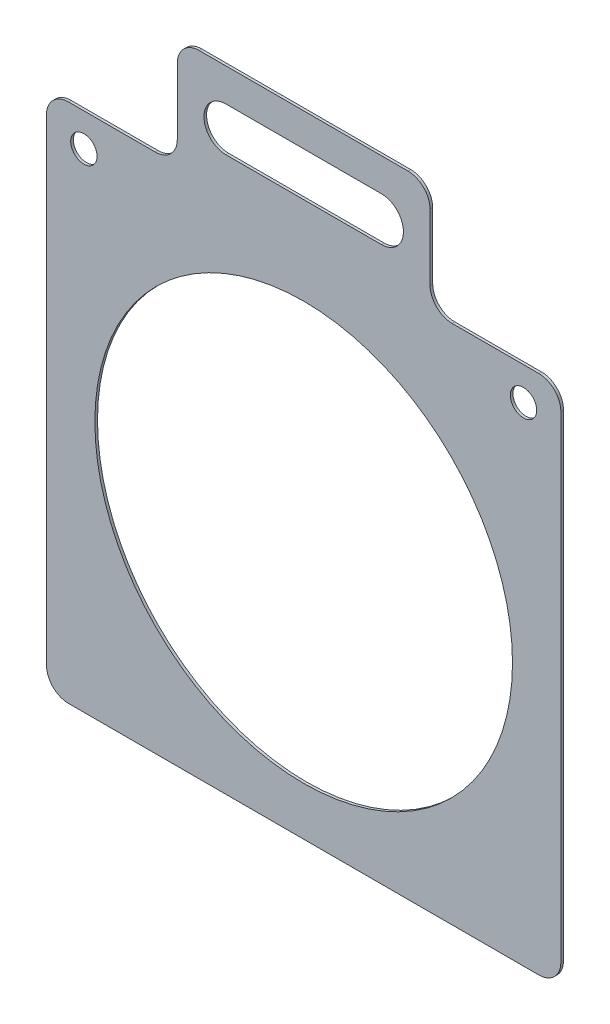
ISO-10303-21;
HEADER;
FILE_DESCRIPTION(('STEP AP214'),'2;1');
FILE_NAME('part.step','',(''),(''),'','','');
FILE_SCHEMA(('AUTOMOTIVE_DESIGN { 1 0 10303 214 1 1 1 1 }'));
ENDSEC;
DATA;
#1=APPLICATION_CONTEXT('core data for automotive mechanical design processes');
#2=APPLICATION_PROTOCOL_DEFINITION('international standard','automotive_design',2000,#1);
#3=PRODUCT_CONTEXT('',#1,'mechanical');
#4=PRODUCT('Part','Part','',(#3));
#5=PRODUCT_RELATED_PRODUCT_CATEGORY('part','',(#4));
#6=PRODUCT_DEFINITION_FORMATION('','',#4);
#7=PRODUCT_DEFINITION_CONTEXT('part definition',#1,'design');
#8=PRODUCT_DEFINITION('design','',#6,#7);
#9=PRODUCT_DEFINITION_SHAPE('','',#8);
#10=(LENGTH_UNIT() NAMED_UNIT(*) SI_UNIT(.MILLI.,.METRE.));
#11=(NAMED_UNIT(*) PLANE_ANGLE_UNIT() SI_UNIT($,.RADIAN.));
#12=(NAMED_UNIT(*) SI_UNIT($,.STERADIAN.) SOLID_ANGLE_UNIT());
#13=UNCERTAINTY_MEASURE_WITH_UNIT(LENGTH_MEASURE(1.E-05),#10,'distance_accuracy_value','');
#14=(GEOMETRIC_REPRESENTATION_CONTEXT(3) GLOBAL_UNCERTAINTY_ASSIGNED_CONTEXT((#13)) GLOBAL_UNIT_ASSIGNED_CONTEXT((#10,
#11,#12)) REPRESENTATION_CONTEXT('',''));
#15=CARTESIAN_POINT('',(0.,0.,0.));
#16=DIRECTION('',(0.,0.,1.));
#17=DIRECTION('',(1.,0.,0.));
#18=AXIS2_PLACEMENT_3D('',#15,#16,#17);
#19=CARTESIAN_POINT('',(-117.,120.,1.19999999999999));
#20=DIRECTION('',(0.,-1.,0.));
#21=DIRECTION('',(1.,0.,0.));
#22=AXIS2_PLACEMENT_3D('',#19,#20,#21);
#23=PLANE('',#22);
#24=DIRECTION('',(-1.,0.,0.));
#25=VECTOR('',#24,1.);
#26=CARTESIAN_POINT('',(-117.,120.,1.19999999999999));
#27=LINE('',#26,#25);
#28=CARTESIAN_POINT('',(-67.5000000000002,120.000000000001,1.19999999999999));
#29=VERTEX_POINT('',#28);
#30=CARTESIAN_POINT('',(-107.,120.,1.19999999999999));
#31=VERTEX_POINT('',#30);
#32=EDGE_CURVE('E276',#29,#31,#27,.T.);
#33=ORIENTED_EDGE('',*,*,#32,.F.);
#34=DIRECTION('',(0.,0.,1.));
#35=VECTOR('',#34,1.);
#36=CARTESIAN_POINT('',(-67.5000000000002,120.000000000001,1.19999999999999));
#37=LINE('',#36,#35);
#38=CARTESIAN_POINT('',(-67.5000000000001,120.000000000001,0.));
#39=VERTEX_POINT('',#38);
#40=EDGE_CURVE('E361',#29,#39,#37,.F.);
#41=ORIENTED_EDGE('',*,*,#40,.T.);
#42=DIRECTION('',(-1.,0.,0.));
#43=VECTOR('',#42,1.);
#44=CARTESIAN_POINT('',(-117.,120.000000000001,0.));
#45=LINE('',#44,#43);
#46=CARTESIAN_POINT('',(-107.,120.,0.));
#47=VERTEX_POINT('',#46);
#48=EDGE_CURVE('E291',#39,#47,#45,.T.);
#49=ORIENTED_EDGE('',*,*,#48,.T.);
#50=DIRECTION('',(0.,0.,-1.));
#51=VECTOR('',#50,1.);
#52=CARTESIAN_POINT('',(-107.,120.,1.19999999999999));
#53=LINE('',#52,#51);
#54=EDGE_CURVE('E358',#47,#31,#53,.F.);
#55=ORIENTED_EDGE('',*,*,#54,.T.);
#56=EDGE_LOOP('',(#33,#41,#49,#55));
#57=FACE_BOUND('',#56,.T.);
#58=ADVANCED_FACE('F40',(#57),#23,.F.);
#59=CARTESIAN_POINT('',(0.,0.,1.19999999999998));
#60=DIRECTION('',(0.,0.,1.));
#61=DIRECTION('',(1.,0.,0.));
#62=AXIS2_PLACEMENT_3D('',#59,#60,#61);
#63=PLANE('',#62);
#64=CARTESIAN_POINT('',(-100.,105.,1.19999999999999));
#65=DIRECTION('',(0.,0.,1.));
#66=DIRECTION('',(1.,0.,0.));
#67=AXIS2_PLACEMENT_3D('',#64,#65,#66);
#68=CIRCLE('',#67,6.);
#69=CARTESIAN_POINT('',(-94.0000000000001,105.,1.19999999999999));
#70=VERTEX_POINT('',#69);
#71=EDGE_CURVE('E247',#70,#70,#68,.T.);
#72=ORIENTED_EDGE('',*,*,#71,.F.);
#73=EDGE_LOOP('',(#72));
#74=FACE_BOUND('',#73,.T.);
#75=DIRECTION('',(0.,1.,0.));
#76=VECTOR('',#75,1.);
#77=CARTESIAN_POINT('',(57.5000000000002,170.000000000002,1.19999999999999));
#78=LINE('',#77,#76);
#79=CARTESIAN_POINT('',(57.5000000000003,130.000000000001,1.19999999999999));
#80=VERTEX_POINT('',#79);
#81=CARTESIAN_POINT('',(57.5000000000001,160.000000000002,1.19999999999999));
#82=VERTEX_POINT('',#81);
#83=EDGE_CURVE('E217',#80,#82,#78,.T.);
#84=ORIENTED_EDGE('',*,*,#83,.T.);
#85=CARTESIAN_POINT('',(47.5,160.000000000002,1.19999999999999));
#86=DIRECTION('',(0.,0.,1.));
#87=DIRECTION('',(1.,0.,0.));
#88=AXIS2_PLACEMENT_3D('',#85,#86,#87);
#89=CIRCLE('',#88,10.);
#90=CARTESIAN_POINT('',(47.5000000000002,170.000000000002,1.19999999999999));
#91=VERTEX_POINT('',#90);
#92=EDGE_CURVE('E325',#82,#91,#89,.T.);
#93=ORIENTED_EDGE('',*,*,#92,.T.);
#94=DIRECTION('',(-1.,0.,0.));
#95=VECTOR('',#94,1.);
#96=CARTESIAN_POINT('',(-57.5000000000003,170.000000000002,1.19999999999999));
#97=LINE('',#96,#95);
#98=CARTESIAN_POINT('',(-47.5000000000001,170.000000000002,1.19999999999999));
#99=VERTEX_POINT('',#98);
#100=EDGE_CURVE('E225',#91,#99,#97,.T.);
#101=ORIENTED_EDGE('',*,*,#100,.T.);
#102=CARTESIAN_POINT('',(-47.5000000000002,160.000000000002,1.19999999999999));
#103=DIRECTION('',(0.,0.,1.));
#104=DIRECTION('',(1.,0.,0.));
#105=AXIS2_PLACEMENT_3D('',#102,#103,#104);
#106=CIRCLE('',#105,10.);
#107=CARTESIAN_POINT('',(-57.5,160.000000000002,1.19999999999999));
#108=VERTEX_POINT('',#107);
#109=EDGE_CURVE('E322',#99,#108,#106,.T.);
#110=ORIENTED_EDGE('',*,*,#109,.T.);
#111=DIRECTION('',(0.,-1.,0.));
#112=VECTOR('',#111,1.);
#113=CARTESIAN_POINT('',(-57.4999999999999,120.000000000002,1.19999999999999));
#114=LINE('',#113,#112);
#115=CARTESIAN_POINT('',(-57.5000000000002,130.000000000001,1.19999999999998));
#116=VERTEX_POINT('',#115);
#117=EDGE_CURVE('E229',#108,#116,#114,.T.);
#118=ORIENTED_EDGE('',*,*,#117,.T.);
#119=CARTESIAN_POINT('',(-67.5,130.000000000001,1.19999999999999));
#120=DIRECTION('',(0.,0.,1.));
#121=DIRECTION('',(1.,0.,0.));
#122=AXIS2_PLACEMENT_3D('',#119,#120,#121);
#123=CIRCLE('',#122,10.);
#124=EDGE_CURVE('E49',#116,#29,#123,.F.);
#125=ORIENTED_EDGE('',*,*,#124,.T.);
#126=ORIENTED_EDGE('',*,*,#32,.T.);
#127=CARTESIAN_POINT('',(-107.,110.,1.19999999999999));
#128=DIRECTION('',(0.,0.,1.));
#129=DIRECTION('',(1.,0.,0.));
#130=AXIS2_PLACEMENT_3D('',#127,#128,#129);
#131=CIRCLE('',#130,10.);
#132=CARTESIAN_POINT('',(-117.,110.,1.19999999999999));
#133=VERTEX_POINT('',#132);
#134=EDGE_CURVE('E319',#31,#133,#131,.T.);
#135=ORIENTED_EDGE('',*,*,#134,.T.);
#136=DIRECTION('',(0.,-1.,0.));
#137=VECTOR('',#136,1.);
#138=CARTESIAN_POINT('',(-117.,120.,1.19999999999999));
#139=LINE('',#138,#137);
#140=CARTESIAN_POINT('',(-117.,-107.,1.19999999999998));
#141=VERTEX_POINT('',#140);
#142=EDGE_CURVE('E263',#133,#141,#139,.T.);
#143=ORIENTED_EDGE('',*,*,#142,.T.);
#144=CARTESIAN_POINT('',(-107.,-107.,1.19999999999998));
#145=DIRECTION('',(0.,0.,1.));
#146=DIRECTION('',(1.,0.,0.));
#147=AXIS2_PLACEMENT_3D('',#144,#145,#146);
#148=CIRCLE('',#147,10.);
#149=CARTESIAN_POINT('',(-107.,-117.,1.19999999999998));
#150=VERTEX_POINT('',#149);
#151=EDGE_CURVE('E313',#141,#150,#148,.T.);
#152=ORIENTED_EDGE('',*,*,#151,.T.);
#153=DIRECTION('',(1.,0.,0.));
#154=VECTOR('',#153,1.);
#155=CARTESIAN_POINT('',(-117.,-117.,1.19999999999998));
#156=LINE('',#155,#154);
#157=CARTESIAN_POINT('',(107.,-117.,1.19999999999998));
#158=VERTEX_POINT('',#157);
#159=EDGE_CURVE('E267',#150,#158,#156,.T.);
#160=ORIENTED_EDGE('',*,*,#159,.T.);
#161=CARTESIAN_POINT('',(107.,-107.,1.19999999999998));
#162=DIRECTION('',(0.,0.,1.));
#163=DIRECTION('',(1.,0.,0.));
#164=AXIS2_PLACEMENT_3D('',#161,#162,#163);
#165=CIRCLE('',#164,10.);
#166=CARTESIAN_POINT('',(117.,-107.,1.19999999999998));
#167=VERTEX_POINT('',#166);
#168=EDGE_CURVE('E316',#158,#167,#165,.T.);
#169=ORIENTED_EDGE('',*,*,#168,.T.);
#170=DIRECTION('',(0.,1.,0.));
#171=VECTOR('',#170,1.);
#172=CARTESIAN_POINT('',(117.,120.000000000001,1.19999999999998));
#173=LINE('',#172,#171);
#174=CARTESIAN_POINT('',(117.,110.,1.19999999999998));
#175=VERTEX_POINT('',#174);
#176=EDGE_CURVE('E272',#167,#175,#173,.T.);
#177=ORIENTED_EDGE('',*,*,#176,.T.);
#178=CARTESIAN_POINT('',(107.,110.000000000001,1.19999999999998));
#179=DIRECTION('',(0.,0.,1.));
#180=DIRECTION('',(1.,0.,0.));
#181=AXIS2_PLACEMENT_3D('',#178,#179,#180);
#182=CIRCLE('',#181,10.);
#183=CARTESIAN_POINT('',(107.,120.000000000001,1.19999999999998));
#184=VERTEX_POINT('',#183);
#185=EDGE_CURVE('E310',#175,#184,#182,.T.);
#186=ORIENTED_EDGE('',*,*,#185,.T.);
#187=CARTESIAN_POINT('',(67.5000000000001,120.000000000001,1.19999999999998));
#188=VERTEX_POINT('',#187);
#189=EDGE_CURVE('E280',#184,#188,#27,.T.);
#190=ORIENTED_EDGE('',*,*,#189,.T.);
#191=CARTESIAN_POINT('',(67.5000000000003,130.000000000001,1.19999999999998));
#192=DIRECTION('',(0.,0.,1.));
#193=DIRECTION('',(1.,0.,0.));
#194=AXIS2_PLACEMENT_3D('',#191,#192,#193);
#195=CIRCLE('',#194,10.);
#196=EDGE_CURVE('E384',#188,#80,#195,.F.);
#197=ORIENTED_EDGE('',*,*,#196,.T.);
#198=EDGE_LOOP('',(#84,#93,#101,#110,#118,#125,#126,#135,#143,#152,#160,#169,#177,#186,#190,#197));
#199=FACE_BOUND('',#198,.T.);
#200=CARTESIAN_POINT('',(0.,0.,1.19999999999998));
#201=DIRECTION('',(0.,0.,1.));
#202=DIRECTION('',(1.,0.,0.));
#203=AXIS2_PLACEMENT_3D('',#200,#201,#202);
#204=CIRCLE('',#203,95.);
#205=CARTESIAN_POINT('',(95.0000000000002,0.,1.19999999999998));
#206=VERTEX_POINT('',#205);
#207=EDGE_CURVE('E255',#206,#206,#204,.T.);
#208=ORIENTED_EDGE('',*,*,#207,.F.);
#209=EDGE_LOOP('',(#208));
#210=FACE_BOUND('',#209,.T.);
#211=CARTESIAN_POINT('',(100.,105.000000000001,1.19999999999998));
#212=DIRECTION('',(0.,0.,1.));
#213=DIRECTION('',(-1.,0.,0.));
#214=AXIS2_PLACEMENT_3D('',#211,#212,#213);
#215=CIRCLE('',#214,6.);
#216=CARTESIAN_POINT('',(94.0000000000002,105.000000000001,1.19999999999998));
#217=VERTEX_POINT('',#216);
#218=EDGE_CURVE('E237',#217,#217,#215,.T.);
#219=ORIENTED_EDGE('',*,*,#218,.F.);
#220=EDGE_LOOP('',(#219));
#221=FACE_BOUND('',#220,.T.);
#222=DIRECTION('',(1.,0.,0.));
#223=VECTOR('',#222,1.);
#224=CARTESIAN_POINT('',(-35.3706002300001,134.999999999999,1.19999999999999));
#225=LINE('',#224,#223);
#226=CARTESIAN_POINT('',(-35.3706002300001,134.999999999999,1.19999999999999));
#227=VERTEX_POINT('',#226);
#228=CARTESIAN_POINT('',(35.3706002300002,135.,1.19999999999999));
#229=VERTEX_POINT('',#228);
#230=EDGE_CURVE('E195',#227,#229,#225,.T.);
#231=ORIENTED_EDGE('',*,*,#230,.F.);
#232=CARTESIAN_POINT('',(-35.3706002300002,145.000000000002,1.19999999999999));
#233=DIRECTION('',(0.,0.,1.));
#234=DIRECTION('',(1.,0.,0.));
#235=AXIS2_PLACEMENT_3D('',#232,#233,#234);
#236=CIRCLE('',#235,10.0000000000015);
#237=CARTESIAN_POINT('',(-35.3706002300001,155.000000000002,1.19999999999999));
#238=VERTEX_POINT('',#237);
#239=EDGE_CURVE('E202',#238,#227,#236,.T.);
#240=ORIENTED_EDGE('',*,*,#239,.F.);
#241=DIRECTION('',(-1.,0.,0.));
#242=VECTOR('',#241,1.);
#243=CARTESIAN_POINT('',(-35.3706002300001,155.000000000002,1.19999999999999));
#244=LINE('',#243,#242);
#245=CARTESIAN_POINT('',(35.3706002300001,155.000000000002,1.19999999999999));
#246=VERTEX_POINT('',#245);
#247=EDGE_CURVE('E206',#246,#238,#244,.T.);
#248=ORIENTED_EDGE('',*,*,#247,.F.);
#249=CARTESIAN_POINT('',(35.3706002300001,145.000000000002,1.19999999999999));
#250=DIRECTION('',(0.,0.,1.));
#251=DIRECTION('',(1.,0.,0.));
#252=AXIS2_PLACEMENT_3D('',#249,#250,#251);
#253=CIRCLE('',#252,10.0000000000015);
#254=EDGE_CURVE('E185',#229,#246,#253,.T.);
#255=ORIENTED_EDGE('',*,*,#254,.F.);
#256=EDGE_LOOP('',(#231,#240,#248,#255));
#257=FACE_BOUND('',#256,.T.);
#258=ADVANCED_FACE('F204',(#74,#199,#210,#221,#257),#63,.T.);
#259=CARTESIAN_POINT('',(0.,0.,0.));
#260=DIRECTION('',(0.,0.,1.));
#261=DIRECTION('',(1.,0.,0.));
#262=AXIS2_PLACEMENT_3D('',#259,#260,#261);
#263=PLANE('',#262);
#264=DIRECTION('',(1.,0.,0.));
#265=VECTOR('',#264,1.);
#266=CARTESIAN_POINT('',(-57.5000000000002,170.000000000002,0.));
#267=LINE('',#266,#265);
#268=CARTESIAN_POINT('',(-47.5,170.000000000002,0.));
#269=VERTEX_POINT('',#268);
#270=CARTESIAN_POINT('',(47.5000000000002,170.000000000002,0.));
#271=VERTEX_POINT('',#270);
#272=EDGE_CURVE('E236',#269,#271,#267,.T.);
#273=ORIENTED_EDGE('',*,*,#272,.T.);
#274=CARTESIAN_POINT('',(47.5,160.000000000002,0.));
#275=DIRECTION('',(0.,0.,1.));
#276=DIRECTION('',(1.,0.,0.));
#277=AXIS2_PLACEMENT_3D('',#274,#275,#276);
#278=CIRCLE('',#277,10.);
#279=CARTESIAN_POINT('',(57.5000000000001,160.000000000002,0.));
#280=VERTEX_POINT('',#279);
#281=EDGE_CURVE('E348',#271,#280,#278,.F.);
#282=ORIENTED_EDGE('',*,*,#281,.T.);
#283=DIRECTION('',(0.,-1.,0.));
#284=VECTOR('',#283,1.);
#285=CARTESIAN_POINT('',(57.5000000000002,170.000000000002,0.));
#286=LINE('',#285,#284);
#287=CARTESIAN_POINT('',(57.5000000000003,130.000000000001,0.));
#288=VERTEX_POINT('',#287);
#289=EDGE_CURVE('E246',#280,#288,#286,.T.);
#290=ORIENTED_EDGE('',*,*,#289,.T.);
#291=CARTESIAN_POINT('',(67.5000000000003,130.000000000001,0.));
#292=DIRECTION('',(0.,0.,1.));
#293=DIRECTION('',(1.,0.,0.));
#294=AXIS2_PLACEMENT_3D('',#291,#292,#293);
#295=CIRCLE('',#294,10.);
#296=CARTESIAN_POINT('',(67.5000000000001,120.000000000001,0.));
#297=VERTEX_POINT('',#296);
#298=EDGE_CURVE('E387',#288,#297,#295,.T.);
#299=ORIENTED_EDGE('',*,*,#298,.T.);
#300=CARTESIAN_POINT('',(107.,120.000000000001,0.));
#301=VERTEX_POINT('',#300);
#302=EDGE_CURVE('E268',#301,#297,#45,.T.);
#303=ORIENTED_EDGE('',*,*,#302,.F.);
#304=CARTESIAN_POINT('',(107.,110.000000000001,0.));
#305=DIRECTION('',(0.,0.,1.));
#306=DIRECTION('',(1.,0.,0.));
#307=AXIS2_PLACEMENT_3D('',#304,#305,#306);
#308=CIRCLE('',#307,10.);
#309=CARTESIAN_POINT('',(117.,110.,0.));
#310=VERTEX_POINT('',#309);
#311=EDGE_CURVE('E335',#301,#310,#308,.F.);
#312=ORIENTED_EDGE('',*,*,#311,.T.);
#313=DIRECTION('',(0.,1.,0.));
#314=VECTOR('',#313,1.);
#315=CARTESIAN_POINT('',(117.,120.000000000001,0.));
#316=LINE('',#315,#314);
#317=CARTESIAN_POINT('',(117.,-107.,0.));
#318=VERTEX_POINT('',#317);
#319=EDGE_CURVE('E287',#318,#310,#316,.T.);
#320=ORIENTED_EDGE('',*,*,#319,.F.);
#321=CARTESIAN_POINT('',(107.,-107.,0.));
#322=DIRECTION('',(0.,0.,1.));
#323=DIRECTION('',(1.,0.,0.));
#324=AXIS2_PLACEMENT_3D('',#321,#322,#323);
#325=CIRCLE('',#324,10.);
#326=CARTESIAN_POINT('',(107.,-117.,0.));
#327=VERTEX_POINT('',#326);
#328=EDGE_CURVE('E56',#318,#327,#325,.F.);
#329=ORIENTED_EDGE('',*,*,#328,.T.);
#330=DIRECTION('',(1.,0.,0.));
#331=VECTOR('',#330,1.);
#332=CARTESIAN_POINT('',(-117.,-117.,0.));
#333=LINE('',#332,#331);
#334=CARTESIAN_POINT('',(-107.,-117.,0.));
#335=VERTEX_POINT('',#334);
#336=EDGE_CURVE('E284',#335,#327,#333,.T.);
#337=ORIENTED_EDGE('',*,*,#336,.F.);
#338=CARTESIAN_POINT('',(-107.,-107.,0.));
#339=DIRECTION('',(0.,0.,1.));
#340=DIRECTION('',(1.,0.,0.));
#341=AXIS2_PLACEMENT_3D('',#338,#339,#340);
#342=CIRCLE('',#341,10.);
#343=CARTESIAN_POINT('',(-117.,-107.,0.));
#344=VERTEX_POINT('',#343);
#345=EDGE_CURVE('E64',#335,#344,#342,.F.);
#346=ORIENTED_EDGE('',*,*,#345,.T.);
#347=DIRECTION('',(0.,-1.,0.));
#348=VECTOR('',#347,1.);
#349=CARTESIAN_POINT('',(-117.,120.000000000001,0.));
#350=LINE('',#349,#348);
#351=CARTESIAN_POINT('',(-117.,110.,0.));
#352=VERTEX_POINT('',#351);
#353=EDGE_CURVE('E259',#352,#344,#350,.T.);
#354=ORIENTED_EDGE('',*,*,#353,.F.);
#355=CARTESIAN_POINT('',(-107.,110.,0.));
#356=DIRECTION('',(0.,0.,1.));
#357=DIRECTION('',(1.,0.,0.));
#358=AXIS2_PLACEMENT_3D('',#355,#356,#357);
#359=CIRCLE('',#358,10.);
#360=EDGE_CURVE('E342',#352,#47,#359,.F.);
#361=ORIENTED_EDGE('',*,*,#360,.T.);
#362=ORIENTED_EDGE('',*,*,#48,.F.);
#363=CARTESIAN_POINT('',(-67.5,130.000000000001,0.));
#364=DIRECTION('',(0.,0.,1.));
#365=DIRECTION('',(1.,0.,0.));
#366=AXIS2_PLACEMENT_3D('',#363,#364,#365);
#367=CIRCLE('',#366,10.);
#368=CARTESIAN_POINT('',(-57.5000000000001,130.000000000001,0.));
#369=VERTEX_POINT('',#368);
#370=EDGE_CURVE('E11',#39,#369,#367,.T.);
#371=ORIENTED_EDGE('',*,*,#370,.T.);
#372=DIRECTION('',(0.,1.,0.));
#373=VECTOR('',#372,1.);
#374=CARTESIAN_POINT('',(-57.4999999999999,120.000000000002,0.));
#375=LINE('',#374,#373);
#376=CARTESIAN_POINT('',(-57.5,160.000000000002,0.));
#377=VERTEX_POINT('',#376);
#378=EDGE_CURVE('E410',#369,#377,#375,.T.);
#379=ORIENTED_EDGE('',*,*,#378,.T.);
#380=CARTESIAN_POINT('',(-47.5,160.000000000002,0.));
#381=DIRECTION('',(0.,0.,1.));
#382=DIRECTION('',(1.,0.,0.));
#383=AXIS2_PLACEMENT_3D('',#380,#381,#382);
#384=CIRCLE('',#383,10.);
#385=EDGE_CURVE('E345',#377,#269,#384,.F.);
#386=ORIENTED_EDGE('',*,*,#385,.T.);
#387=EDGE_LOOP('',(#273,#282,#290,#299,#303,#312,#320,#329,#337,#346,#354,#361,#362,#371,#379,#386));
#388=FACE_BOUND('',#387,.T.);
#389=CARTESIAN_POINT('',(0.,0.,0.));
#390=DIRECTION('',(0.,0.,1.));
#391=DIRECTION('',(1.,0.,0.));
#392=AXIS2_PLACEMENT_3D('',#389,#390,#391);
#393=CIRCLE('',#392,95.);
#394=CARTESIAN_POINT('',(95.0000000000002,0.,0.));
#395=VERTEX_POINT('',#394);
#396=EDGE_CURVE('E251',#395,#395,#393,.T.);
#397=ORIENTED_EDGE('',*,*,#396,.T.);
#398=EDGE_LOOP('',(#397));
#399=FACE_BOUND('',#398,.T.);
#400=CARTESIAN_POINT('',(-100.,105.,0.));
#401=DIRECTION('',(0.,0.,1.));
#402=DIRECTION('',(1.,0.,0.));
#403=AXIS2_PLACEMENT_3D('',#400,#401,#402);
#404=CIRCLE('',#403,6.);
#405=CARTESIAN_POINT('',(-94.0000000000001,105.,0.));
#406=VERTEX_POINT('',#405);
#407=EDGE_CURVE('E241',#406,#406,#404,.T.);
#408=ORIENTED_EDGE('',*,*,#407,.T.);
#409=EDGE_LOOP('',(#408));
#410=FACE_BOUND('',#409,.T.);
#411=CARTESIAN_POINT('',(100.,105.000000000001,0.));
#412=DIRECTION('',(0.,0.,1.));
#413=DIRECTION('',(-1.,0.,0.));
#414=AXIS2_PLACEMENT_3D('',#411,#412,#413);
#415=CIRCLE('',#414,6.);
#416=CARTESIAN_POINT('',(94.0000000000002,105.000000000001,0.));
#417=VERTEX_POINT('',#416);
#418=EDGE_CURVE('E242',#417,#417,#415,.T.);
#419=ORIENTED_EDGE('',*,*,#418,.T.);
#420=EDGE_LOOP('',(#419));
#421=FACE_BOUND('',#420,.T.);
#422=DIRECTION('',(-1.,0.,0.));
#423=VECTOR('',#422,1.);
#424=CARTESIAN_POINT('',(-35.3706002300001,134.999999999999,0.));
#425=LINE('',#424,#423);
#426=CARTESIAN_POINT('',(35.3706002300001,134.999999999999,0.));
#427=VERTEX_POINT('',#426);
#428=CARTESIAN_POINT('',(-35.3706002300001,134.999999999999,0.));
#429=VERTEX_POINT('',#428);
#430=EDGE_CURVE('E233',#427,#429,#425,.T.);
#431=ORIENTED_EDGE('',*,*,#430,.F.);
#432=CARTESIAN_POINT('',(35.3706002300001,145.000000000002,0.));
#433=DIRECTION('',(0.,0.,1.));
#434=DIRECTION('',(1.,0.,0.));
#435=AXIS2_PLACEMENT_3D('',#432,#433,#434);
#436=CIRCLE('',#435,10.0000000000015);
#437=CARTESIAN_POINT('',(35.3706002300001,155.000000000004,0.));
#438=VERTEX_POINT('',#437);
#439=EDGE_CURVE('E187',#438,#427,#436,.F.);
#440=ORIENTED_EDGE('',*,*,#439,.F.);
#441=DIRECTION('',(1.,0.,0.));
#442=VECTOR('',#441,1.);
#443=CARTESIAN_POINT('',(-35.3706002300001,155.000000000002,0.));
#444=LINE('',#443,#442);
#445=CARTESIAN_POINT('',(-35.3706002300001,155.000000000002,0.));
#446=VERTEX_POINT('',#445);
#447=EDGE_CURVE('E420',#446,#438,#444,.T.);
#448=ORIENTED_EDGE('',*,*,#447,.F.);
#449=CARTESIAN_POINT('',(-35.3706002300002,145.000000000002,0.));
#450=DIRECTION('',(0.,0.,1.));
#451=DIRECTION('',(1.,0.,0.));
#452=AXIS2_PLACEMENT_3D('',#449,#450,#451);
#453=CIRCLE('',#452,10.0000000000015);
#454=EDGE_CURVE('E415',#429,#446,#453,.F.);
#455=ORIENTED_EDGE('',*,*,#454,.F.);
#456=EDGE_LOOP('',(#431,#440,#448,#455));
#457=FACE_BOUND('',#456,.T.);
#458=ADVANCED_FACE('F408',(#388,#399,#410,#421,#457),#263,.F.);
#459=CARTESIAN_POINT('',(-117.,120.,1.19999999999999));
#460=DIRECTION('',(1.,0.,0.));
#461=DIRECTION('',(0.,1.,0.));
#462=AXIS2_PLACEMENT_3D('',#459,#460,#461);
#463=PLANE('',#462);
#464=ORIENTED_EDGE('',*,*,#142,.F.);
#465=DIRECTION('',(0.,0.,-1.));
#466=VECTOR('',#465,1.);
#467=CARTESIAN_POINT('',(-117.,110.,1.19999999999999));
#468=LINE('',#467,#466);
#469=EDGE_CURVE('E367',#133,#352,#468,.T.);
#470=ORIENTED_EDGE('',*,*,#469,.T.);
#471=ORIENTED_EDGE('',*,*,#353,.T.);
#472=DIRECTION('',(0.,0.,-1.));
#473=VECTOR('',#472,1.);
#474=CARTESIAN_POINT('',(-117.,-107.,1.19999999999998));
#475=LINE('',#474,#473);
#476=EDGE_CURVE('E364',#344,#141,#475,.F.);
#477=ORIENTED_EDGE('',*,*,#476,.T.);
#478=EDGE_LOOP('',(#464,#470,#471,#477));
#479=FACE_BOUND('',#478,.T.);
#480=ADVANCED_FACE('F482',(#479),#463,.F.);
#481=CARTESIAN_POINT('',(-117.,-117.,1.19999999999998));
#482=DIRECTION('',(0.,1.,0.));
#483=DIRECTION('',(-1.,0.,0.));
#484=AXIS2_PLACEMENT_3D('',#481,#482,#483);
#485=PLANE('',#484);
#486=ORIENTED_EDGE('',*,*,#336,.T.);
#487=DIRECTION('',(0.,0.,-1.));
#488=VECTOR('',#487,1.);
#489=CARTESIAN_POINT('',(107.,-117.,1.19999999999998));
#490=LINE('',#489,#488);
#491=EDGE_CURVE('E381',#327,#158,#490,.F.);
#492=ORIENTED_EDGE('',*,*,#491,.T.);
#493=ORIENTED_EDGE('',*,*,#159,.F.);
#494=DIRECTION('',(0.,0.,-1.));
#495=VECTOR('',#494,1.);
#496=CARTESIAN_POINT('',(-107.,-117.,1.19999999999998));
#497=LINE('',#496,#495);
#498=EDGE_CURVE('E378',#150,#335,#497,.T.);
#499=ORIENTED_EDGE('',*,*,#498,.T.);
#500=EDGE_LOOP('',(#486,#492,#493,#499));
#501=FACE_BOUND('',#500,.T.);
#502=ADVANCED_FACE('F476',(#501),#485,.F.);
#503=CARTESIAN_POINT('',(117.,120.000000000001,1.19999999999998));
#504=DIRECTION('',(-1.,0.,0.));
#505=DIRECTION('',(0.,-1.,0.));
#506=AXIS2_PLACEMENT_3D('',#503,#504,#505);
#507=PLANE('',#506);
#508=ORIENTED_EDGE('',*,*,#176,.F.);
#509=DIRECTION('',(0.,0.,-1.));
#510=VECTOR('',#509,1.);
#511=CARTESIAN_POINT('',(117.,-107.,1.19999999999998));
#512=LINE('',#511,#510);
#513=EDGE_CURVE('E374',#167,#318,#512,.T.);
#514=ORIENTED_EDGE('',*,*,#513,.T.);
#515=ORIENTED_EDGE('',*,*,#319,.T.);
#516=DIRECTION('',(0.,0.,-1.));
#517=VECTOR('',#516,1.);
#518=CARTESIAN_POINT('',(117.,110.,1.19999999999998));
#519=LINE('',#518,#517);
#520=EDGE_CURVE('E371',#310,#175,#519,.F.);
#521=ORIENTED_EDGE('',*,*,#520,.T.);
#522=EDGE_LOOP('',(#508,#514,#515,#521));
#523=FACE_BOUND('',#522,.T.);
#524=ADVANCED_FACE('F468',(#523),#507,.F.);
#525=ORIENTED_EDGE('',*,*,#302,.T.);
#526=DIRECTION('',(0.,0.,1.));
#527=VECTOR('',#526,1.);
#528=CARTESIAN_POINT('',(67.5000000000003,120.000000000001,1.19999999999998));
#529=LINE('',#528,#527);
#530=EDGE_CURVE('E299',#297,#188,#529,.T.);
#531=ORIENTED_EDGE('',*,*,#530,.T.);
#532=ORIENTED_EDGE('',*,*,#189,.F.);
#533=DIRECTION('',(0.,0.,-1.));
#534=VECTOR('',#533,1.);
#535=CARTESIAN_POINT('',(107.,120.,1.19999999999998));
#536=LINE('',#535,#534);
#537=EDGE_CURVE('E295',#184,#301,#536,.T.);
#538=ORIENTED_EDGE('',*,*,#537,.T.);
#539=EDGE_LOOP('',(#525,#531,#532,#538));
#540=FACE_BOUND('',#539,.T.);
#541=ADVANCED_FACE('F457',(#540),#23,.F.);
#542=CARTESIAN_POINT('',(0.,0.,1.19999999999998));
#543=DIRECTION('',(0.,0.,-1.));
#544=DIRECTION('',(-1.,0.,0.));
#545=AXIS2_PLACEMENT_3D('',#542,#543,#544);
#546=CYLINDRICAL_SURFACE('',#545,95.);
#547=ORIENTED_EDGE('',*,*,#207,.T.);
#548=EDGE_LOOP('',(#547));
#549=FACE_BOUND('',#548,.T.);
#550=ORIENTED_EDGE('',*,*,#396,.F.);
#551=EDGE_LOOP('',(#550));
#552=FACE_BOUND('',#551,.T.);
#553=ADVANCED_FACE('F505',(#549,#552),#546,.F.);
#554=CARTESIAN_POINT('',(-100.,105.,1.19999999999999));
#555=DIRECTION('',(0.,0.,-1.));
#556=DIRECTION('',(-1.,0.,0.));
#557=AXIS2_PLACEMENT_3D('',#554,#555,#556);
#558=CYLINDRICAL_SURFACE('',#557,6.);
#559=ORIENTED_EDGE('',*,*,#71,.T.);
#560=EDGE_LOOP('',(#559));
#561=FACE_BOUND('',#560,.T.);
#562=ORIENTED_EDGE('',*,*,#407,.F.);
#563=EDGE_LOOP('',(#562));
#564=FACE_BOUND('',#563,.T.);
#565=ADVANCED_FACE('F510',(#561,#564),#558,.F.);
#566=CARTESIAN_POINT('',(100.,105.000000000001,1.19999999999998));
#567=DIRECTION('',(0.,0.,-1.));
#568=DIRECTION('',(-1.,0.,0.));
#569=AXIS2_PLACEMENT_3D('',#566,#567,#568);
#570=CYLINDRICAL_SURFACE('',#569,6.);
#571=ORIENTED_EDGE('',*,*,#218,.T.);
#572=EDGE_LOOP('',(#571));
#573=FACE_BOUND('',#572,.T.);
#574=ORIENTED_EDGE('',*,*,#418,.F.);
#575=EDGE_LOOP('',(#574));
#576=FACE_BOUND('',#575,.T.);
#577=ADVANCED_FACE('F538',(#573,#576),#570,.F.);
#578=CARTESIAN_POINT('',(57.5000000000002,170.000000000002,-125.399362039845));
#579=DIRECTION('',(1.,0.,0.));
#580=DIRECTION('',(0.,1.,0.));
#581=AXIS2_PLACEMENT_3D('',#578,#579,#580);
#582=PLANE('',#581);
#583=ORIENTED_EDGE('',*,*,#83,.F.);
#584=DIRECTION('',(0.,0.,1.));
#585=VECTOR('',#584,1.);
#586=CARTESIAN_POINT('',(57.5000000000003,130.000000000001,-125.399362039845));
#587=LINE('',#586,#585);
#588=EDGE_CURVE('E307',#80,#288,#587,.F.);
#589=ORIENTED_EDGE('',*,*,#588,.T.);
#590=ORIENTED_EDGE('',*,*,#289,.F.);
#591=DIRECTION('',(0.,0.,1.));
#592=VECTOR('',#591,1.);
#593=CARTESIAN_POINT('',(57.5000000000002,160.000000000002,-125.399362039845));
#594=LINE('',#593,#592);
#595=EDGE_CURVE('E303',#280,#82,#594,.T.);
#596=ORIENTED_EDGE('',*,*,#595,.T.);
#597=EDGE_LOOP('',(#583,#589,#590,#596));
#598=FACE_BOUND('',#597,.T.);
#599=ADVANCED_FACE('F536',(#598),#582,.T.);
#600=CARTESIAN_POINT('',(-57.5000000000003,170.000000000002,-125.399362039845));
#601=DIRECTION('',(0.,1.,0.));
#602=DIRECTION('',(0.,0.,1.));
#603=AXIS2_PLACEMENT_3D('',#600,#601,#602);
#604=PLANE('',#603);
#605=ORIENTED_EDGE('',*,*,#100,.F.);
#606=DIRECTION('',(0.,0.,1.));
#607=VECTOR('',#606,1.);
#608=CARTESIAN_POINT('',(47.5000000000003,170.000000000002,-125.399362039845));
#609=LINE('',#608,#607);
#610=EDGE_CURVE('E332',#91,#271,#609,.F.);
#611=ORIENTED_EDGE('',*,*,#610,.T.);
#612=ORIENTED_EDGE('',*,*,#272,.F.);
#613=DIRECTION('',(0.,0.,1.));
#614=VECTOR('',#613,1.);
#615=CARTESIAN_POINT('',(-47.5000000000002,170.000000000002,-125.399362039845));
#616=LINE('',#615,#614);
#617=EDGE_CURVE('E328',#269,#99,#616,.T.);
#618=ORIENTED_EDGE('',*,*,#617,.T.);
#619=EDGE_LOOP('',(#605,#611,#612,#618));
#620=FACE_BOUND('',#619,.T.);
#621=ADVANCED_FACE('F534',(#620),#604,.T.);
#622=CARTESIAN_POINT('',(-57.4999999999999,120.000000000002,-125.399362039845));
#623=DIRECTION('',(-1.,0.,0.));
#624=DIRECTION('',(0.,0.,1.));
#625=AXIS2_PLACEMENT_3D('',#622,#623,#624);
#626=PLANE('',#625);
#627=ORIENTED_EDGE('',*,*,#117,.F.);
#628=DIRECTION('',(0.,0.,1.));
#629=VECTOR('',#628,1.);
#630=CARTESIAN_POINT('',(-57.5000000000002,160.000000000002,-125.399362039845));
#631=LINE('',#630,#629);
#632=EDGE_CURVE('E355',#108,#377,#631,.F.);
#633=ORIENTED_EDGE('',*,*,#632,.T.);
#634=ORIENTED_EDGE('',*,*,#378,.F.);
#635=DIRECTION('',(0.,0.,1.));
#636=VECTOR('',#635,1.);
#637=CARTESIAN_POINT('',(-57.5000000000001,130.000000000001,-125.399362039845));
#638=LINE('',#637,#636);
#639=EDGE_CURVE('E351',#369,#116,#638,.T.);
#640=ORIENTED_EDGE('',*,*,#639,.T.);
#641=EDGE_LOOP('',(#627,#633,#634,#640));
#642=FACE_BOUND('',#641,.T.);
#643=ADVANCED_FACE('F413',(#642),#626,.T.);
#644=CARTESIAN_POINT('',(-35.3706002300003,134.999999999999,-125.399362039845));
#645=DIRECTION('',(0.,-1.,0.));
#646=DIRECTION('',(0.,0.,-1.));
#647=AXIS2_PLACEMENT_3D('',#644,#645,#646);
#648=PLANE('',#647);
#649=DIRECTION('',(0.,0.,1.));
#650=VECTOR('',#649,1.);
#651=CARTESIAN_POINT('',(35.3706002300001,135.,-125.399362039845));
#652=LINE('',#651,#650);
#653=EDGE_CURVE('E180',#427,#229,#652,.T.);
#654=ORIENTED_EDGE('',*,*,#653,.F.);
#655=ORIENTED_EDGE('',*,*,#430,.T.);
#656=DIRECTION('',(0.,0.,1.));
#657=VECTOR('',#656,1.);
#658=CARTESIAN_POINT('',(-35.3706002300003,134.999999999999,-125.399362039845));
#659=LINE('',#658,#657);
#660=EDGE_CURVE('E192',#429,#227,#659,.T.);
#661=ORIENTED_EDGE('',*,*,#660,.T.);
#662=ORIENTED_EDGE('',*,*,#230,.T.);
#663=EDGE_LOOP('',(#654,#655,#661,#662));
#664=FACE_BOUND('',#663,.T.);
#665=ADVANCED_FACE('F196',(#664),#648,.F.);
#666=CARTESIAN_POINT('',(35.3706002300001,145.000000000002,-125.399362039845));
#667=DIRECTION('',(0.,0.,1.));
#668=DIRECTION('',(1.,0.,0.));
#669=AXIS2_PLACEMENT_3D('',#666,#667,#668);
#670=CYLINDRICAL_SURFACE('',#669,10.0000000000015);
#671=DIRECTION('',(0.,0.,1.));
#672=VECTOR('',#671,1.);
#673=CARTESIAN_POINT('',(35.3706002300001,155.000000000002,-125.399362039845));
#674=LINE('',#673,#672);
#675=EDGE_CURVE('E191',#438,#246,#674,.T.);
#676=ORIENTED_EDGE('',*,*,#675,.F.);
#677=ORIENTED_EDGE('',*,*,#439,.T.);
#678=ORIENTED_EDGE('',*,*,#653,.T.);
#679=ORIENTED_EDGE('',*,*,#254,.T.);
#680=EDGE_LOOP('',(#676,#677,#678,#679));
#681=FACE_BOUND('',#680,.T.);
#682=ADVANCED_FACE('F183',(#681),#670,.F.);
#683=CARTESIAN_POINT('',(-35.3706002300002,155.000000000002,-125.399362039845));
#684=DIRECTION('',(0.,1.,0.));
#685=DIRECTION('',(0.,0.,1.));
#686=AXIS2_PLACEMENT_3D('',#683,#684,#685);
#687=PLANE('',#686);
#688=DIRECTION('',(0.,0.,1.));
#689=VECTOR('',#688,1.);
#690=CARTESIAN_POINT('',(-35.3706002300002,155.000000000002,-125.399362039845));
#691=LINE('',#690,#689);
#692=EDGE_CURVE('E214',#446,#238,#691,.T.);
#693=ORIENTED_EDGE('',*,*,#692,.F.);
#694=ORIENTED_EDGE('',*,*,#447,.T.);
#695=ORIENTED_EDGE('',*,*,#675,.T.);
#696=ORIENTED_EDGE('',*,*,#247,.T.);
#697=EDGE_LOOP('',(#693,#694,#695,#696));
#698=FACE_BOUND('',#697,.T.);
#699=ADVANCED_FACE('F433',(#698),#687,.F.);
#700=CARTESIAN_POINT('',(-35.3706002300002,145.000000000002,-125.399362039845));
#701=DIRECTION('',(0.,0.,1.));
#702=DIRECTION('',(1.,0.,0.));
#703=AXIS2_PLACEMENT_3D('',#700,#701,#702);
#704=CYLINDRICAL_SURFACE('',#703,10.0000000000015);
#705=ORIENTED_EDGE('',*,*,#660,.F.);
#706=ORIENTED_EDGE('',*,*,#454,.T.);
#707=ORIENTED_EDGE('',*,*,#692,.T.);
#708=ORIENTED_EDGE('',*,*,#239,.T.);
#709=EDGE_LOOP('',(#705,#706,#707,#708));
#710=FACE_BOUND('',#709,.T.);
#711=ADVANCED_FACE('F429',(#710),#704,.F.);
#712=CARTESIAN_POINT('',(67.5000000000003,130.000000000001,1.19999999999998));
#713=DIRECTION('',(0.,0.,1.));
#714=DIRECTION('',(1.,0.,0.));
#715=AXIS2_PLACEMENT_3D('',#712,#713,#714);
#716=CYLINDRICAL_SURFACE('',#715,10.);
#717=ORIENTED_EDGE('',*,*,#298,.F.);
#718=ORIENTED_EDGE('',*,*,#588,.F.);
#719=ORIENTED_EDGE('',*,*,#196,.F.);
#720=ORIENTED_EDGE('',*,*,#530,.F.);
#721=EDGE_LOOP('',(#717,#718,#719,#720));
#722=FACE_BOUND('',#721,.T.);
#723=ADVANCED_FACE('F453',(#722),#716,.F.);
#724=CARTESIAN_POINT('',(47.5,160.000000000002,-125.399362039845));
#725=DIRECTION('',(0.,0.,1.));
#726=DIRECTION('',(1.,0.,0.));
#727=AXIS2_PLACEMENT_3D('',#724,#725,#726);
#728=CYLINDRICAL_SURFACE('',#727,10.);
#729=ORIENTED_EDGE('',*,*,#281,.F.);
#730=ORIENTED_EDGE('',*,*,#610,.F.);
#731=ORIENTED_EDGE('',*,*,#92,.F.);
#732=ORIENTED_EDGE('',*,*,#595,.F.);
#733=EDGE_LOOP('',(#729,#730,#731,#732));
#734=FACE_BOUND('',#733,.T.);
#735=ADVANCED_FACE('F522',(#734),#728,.T.);
#736=CARTESIAN_POINT('',(-47.5000000000001,160.000000000002,-125.399362039845));
#737=DIRECTION('',(0.,0.,1.));
#738=DIRECTION('',(1.,0.,0.));
#739=AXIS2_PLACEMENT_3D('',#736,#737,#738);
#740=CYLINDRICAL_SURFACE('',#739,10.);
#741=ORIENTED_EDGE('',*,*,#385,.F.);
#742=ORIENTED_EDGE('',*,*,#632,.F.);
#743=ORIENTED_EDGE('',*,*,#109,.F.);
#744=ORIENTED_EDGE('',*,*,#617,.F.);
#745=EDGE_LOOP('',(#741,#742,#743,#744));
#746=FACE_BOUND('',#745,.T.);
#747=ADVANCED_FACE('F493',(#746),#740,.T.);
#748=CARTESIAN_POINT('',(-67.5000000000003,130.000000000001,-125.399362039845));
#749=DIRECTION('',(0.,0.,1.));
#750=DIRECTION('',(1.,0.,0.));
#751=AXIS2_PLACEMENT_3D('',#748,#749,#750);
#752=CYLINDRICAL_SURFACE('',#751,10.);
#753=ORIENTED_EDGE('',*,*,#370,.F.);
#754=ORIENTED_EDGE('',*,*,#40,.F.);
#755=ORIENTED_EDGE('',*,*,#124,.F.);
#756=ORIENTED_EDGE('',*,*,#639,.F.);
#757=EDGE_LOOP('',(#753,#754,#755,#756));
#758=FACE_BOUND('',#757,.T.);
#759=ADVANCED_FACE('F404',(#758),#752,.F.);
#760=CARTESIAN_POINT('',(-107.,110.,1.19999999999999));
#761=DIRECTION('',(0.,0.,-1.));
#762=DIRECTION('',(-1.,0.,0.));
#763=AXIS2_PLACEMENT_3D('',#760,#761,#762);
#764=CYLINDRICAL_SURFACE('',#763,10.);
#765=ORIENTED_EDGE('',*,*,#134,.F.);
#766=ORIENTED_EDGE('',*,*,#54,.F.);
#767=ORIENTED_EDGE('',*,*,#360,.F.);
#768=ORIENTED_EDGE('',*,*,#469,.F.);
#769=EDGE_LOOP('',(#765,#766,#767,#768));
#770=FACE_BOUND('',#769,.T.);
#771=ADVANCED_FACE('F485',(#770),#764,.T.);
#772=CARTESIAN_POINT('',(107.,-107.,1.19999999999998));
#773=DIRECTION('',(0.,0.,-1.));
#774=DIRECTION('',(-1.,0.,0.));
#775=AXIS2_PLACEMENT_3D('',#772,#773,#774);
#776=CYLINDRICAL_SURFACE('',#775,10.);
#777=ORIENTED_EDGE('',*,*,#168,.F.);
#778=ORIENTED_EDGE('',*,*,#491,.F.);
#779=ORIENTED_EDGE('',*,*,#328,.F.);
#780=ORIENTED_EDGE('',*,*,#513,.F.);
#781=EDGE_LOOP('',(#777,#778,#779,#780));
#782=FACE_BOUND('',#781,.T.);
#783=ADVANCED_FACE('F472',(#782),#776,.T.);
#784=CARTESIAN_POINT('',(-107.,-107.,1.19999999999998));
#785=DIRECTION('',(0.,0.,-1.));
#786=DIRECTION('',(-1.,0.,0.));
#787=AXIS2_PLACEMENT_3D('',#784,#785,#786);
#788=CYLINDRICAL_SURFACE('',#787,10.);
#789=ORIENTED_EDGE('',*,*,#151,.F.);
#790=ORIENTED_EDGE('',*,*,#476,.F.);
#791=ORIENTED_EDGE('',*,*,#345,.F.);
#792=ORIENTED_EDGE('',*,*,#498,.F.);
#793=EDGE_LOOP('',(#789,#790,#791,#792));
#794=FACE_BOUND('',#793,.T.);
#795=ADVANCED_FACE('F479',(#794),#788,.T.);
#796=CARTESIAN_POINT('',(107.,110.000000000001,1.19999999999998));
#797=DIRECTION('',(0.,0.,-1.));
#798=DIRECTION('',(-1.,0.,0.));
#799=AXIS2_PLACEMENT_3D('',#796,#797,#798);
#800=CYLINDRICAL_SURFACE('',#799,10.);
#801=ORIENTED_EDGE('',*,*,#185,.F.);
#802=ORIENTED_EDGE('',*,*,#520,.F.);
#803=ORIENTED_EDGE('',*,*,#311,.F.);
#804=ORIENTED_EDGE('',*,*,#537,.F.);
#805=EDGE_LOOP('',(#801,#802,#803,#804));
#806=FACE_BOUND('',#805,.T.);
#807=ADVANCED_FACE('F42',(#806),#800,.T.);
#808=CLOSED_SHELL('',(#58,#258,#458,#480,#502,#524,#541,#553,#565,#577,#599,#621,#643,#665,#682,
#699,#711,#723,#735,#747,#759,#771,#783,#795,#807));
#809=MANIFOLD_SOLID_BREP('B2',#808);
#810=ADVANCED_BREP_SHAPE_REPRESENTATION('',(#18,#809),#14);
#811=SHAPE_DEFINITION_REPRESENTATION(#9,#810);
ENDSEC;
END-ISO-10303-21;
